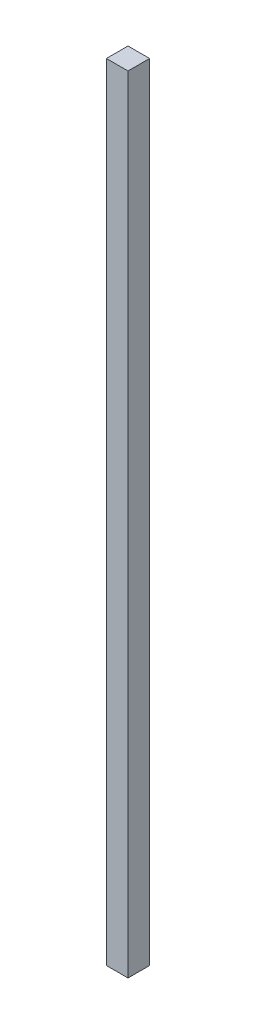
ISO-10303-21;
HEADER;
FILE_DESCRIPTION(('STEP AP214'),'2;1');
FILE_NAME('part.step','',(''),(''),'','','');
FILE_SCHEMA(('AUTOMOTIVE_DESIGN { 1 0 10303 214 1 1 1 1 }'));
ENDSEC;
DATA;
#1=APPLICATION_CONTEXT('core data for automotive mechanical design processes');
#2=APPLICATION_PROTOCOL_DEFINITION('international standard','automotive_design',2000,#1);
#3=PRODUCT_CONTEXT('',#1,'mechanical');
#4=PRODUCT('Part','Part','',(#3));
#5=PRODUCT_RELATED_PRODUCT_CATEGORY('part','',(#4));
#6=PRODUCT_DEFINITION_FORMATION('','',#4);
#7=PRODUCT_DEFINITION_CONTEXT('part definition',#1,'design');
#8=PRODUCT_DEFINITION('design','',#6,#7);
#9=PRODUCT_DEFINITION_SHAPE('','',#8);
#10=(LENGTH_UNIT() NAMED_UNIT(*) SI_UNIT(.MILLI.,.METRE.));
#11=(NAMED_UNIT(*) PLANE_ANGLE_UNIT() SI_UNIT($,.RADIAN.));
#12=(NAMED_UNIT(*) SI_UNIT($,.STERADIAN.) SOLID_ANGLE_UNIT());
#13=UNCERTAINTY_MEASURE_WITH_UNIT(LENGTH_MEASURE(1.E-05),#10,'distance_accuracy_value','');
#14=(GEOMETRIC_REPRESENTATION_CONTEXT(3) GLOBAL_UNCERTAINTY_ASSIGNED_CONTEXT((#13)) GLOBAL_UNIT_ASSIGNED_CONTEXT((#10,
#11,#12)) REPRESENTATION_CONTEXT('',''));
#15=CARTESIAN_POINT('',(0.,0.,0.));
#16=DIRECTION('',(0.,0.,1.));
#17=DIRECTION('',(1.,0.,0.));
#18=AXIS2_PLACEMENT_3D('',#15,#16,#17);
#19=CARTESIAN_POINT('',(1.5,243.242640687119,-1.5));
#20=DIRECTION('',(-1.,0.,0.));
#21=DIRECTION('',(0.,0.,1.));
#22=AXIS2_PLACEMENT_3D('',#19,#20,#21);
#23=PLANE('',#22);
#24=DIRECTION('',(0.,0.,-1.));
#25=VECTOR('',#24,1.);
#26=CARTESIAN_POINT('',(1.5,239.,-1.5));
#27=LINE('',#26,#25);
#28=CARTESIAN_POINT('',(1.5,239.,1.5));
#29=VERTEX_POINT('',#28);
#30=CARTESIAN_POINT('',(1.5,239.,-1.5));
#31=VERTEX_POINT('',#30);
#32=EDGE_CURVE('E97',#29,#31,#27,.T.);
#33=ORIENTED_EDGE('',*,*,#32,.F.);
#34=DIRECTION('',(0.,-1.,0.));
#35=VECTOR('',#34,1.);
#36=CARTESIAN_POINT('',(1.5,243.242640687119,1.5));
#37=LINE('',#36,#35);
#38=CARTESIAN_POINT('',(1.5,130.,1.5));
#39=VERTEX_POINT('',#38);
#40=EDGE_CURVE('E36',#29,#39,#37,.T.);
#41=ORIENTED_EDGE('',*,*,#40,.T.);
#42=DIRECTION('',(0.,0.,-1.));
#43=VECTOR('',#42,1.);
#44=CARTESIAN_POINT('',(1.5,130.,-1.5));
#45=LINE('',#44,#43);
#46=CARTESIAN_POINT('',(1.5,130.,-1.5));
#47=VERTEX_POINT('',#46);
#48=EDGE_CURVE('E49',#39,#47,#45,.T.);
#49=ORIENTED_EDGE('',*,*,#48,.T.);
#50=DIRECTION('',(0.,-1.,0.));
#51=VECTOR('',#50,1.);
#52=CARTESIAN_POINT('',(1.5,243.242640687119,-1.5));
#53=LINE('',#52,#51);
#54=EDGE_CURVE('E93',#31,#47,#53,.T.);
#55=ORIENTED_EDGE('',*,*,#54,.F.);
#56=EDGE_LOOP('',(#33,#41,#49,#55));
#57=FACE_BOUND('',#56,.T.);
#58=ADVANCED_FACE('F32',(#57),#23,.F.);
#59=CARTESIAN_POINT('',(-1.5,243.242640687119,-1.5));
#60=DIRECTION('',(0.,0.,1.));
#61=DIRECTION('',(1.,0.,0.));
#62=AXIS2_PLACEMENT_3D('',#59,#60,#61);
#63=PLANE('',#62);
#64=DIRECTION('',(-1.,0.,0.));
#65=VECTOR('',#64,1.);
#66=CARTESIAN_POINT('',(-1.5,239.,-1.5));
#67=LINE('',#66,#65);
#68=CARTESIAN_POINT('',(-1.5,239.,-1.5));
#69=VERTEX_POINT('',#68);
#70=EDGE_CURVE('E41',#31,#69,#67,.T.);
#71=ORIENTED_EDGE('',*,*,#70,.F.);
#72=ORIENTED_EDGE('',*,*,#54,.T.);
#73=DIRECTION('',(-1.,0.,0.));
#74=VECTOR('',#73,1.);
#75=CARTESIAN_POINT('',(-1.5,130.,-1.5));
#76=LINE('',#75,#74);
#77=CARTESIAN_POINT('',(-1.5,130.,-1.5));
#78=VERTEX_POINT('',#77);
#79=EDGE_CURVE('E89',#47,#78,#76,.T.);
#80=ORIENTED_EDGE('',*,*,#79,.T.);
#81=DIRECTION('',(0.,-1.,0.));
#82=VECTOR('',#81,1.);
#83=CARTESIAN_POINT('',(-1.5,243.242640687119,-1.5));
#84=LINE('',#83,#82);
#85=EDGE_CURVE('E86',#69,#78,#84,.T.);
#86=ORIENTED_EDGE('',*,*,#85,.F.);
#87=EDGE_LOOP('',(#71,#72,#80,#86));
#88=FACE_BOUND('',#87,.T.);
#89=ADVANCED_FACE('F104',(#88),#63,.F.);
#90=CARTESIAN_POINT('',(-1.5,243.242640687119,-1.5));
#91=DIRECTION('',(1.,0.,0.));
#92=DIRECTION('',(0.,0.,-1.));
#93=AXIS2_PLACEMENT_3D('',#90,#91,#92);
#94=PLANE('',#93);
#95=DIRECTION('',(0.,0.,1.));
#96=VECTOR('',#95,1.);
#97=CARTESIAN_POINT('',(-1.5,239.,-1.5));
#98=LINE('',#97,#96);
#99=CARTESIAN_POINT('',(-1.5,239.,1.5));
#100=VERTEX_POINT('',#99);
#101=EDGE_CURVE('E11',#69,#100,#98,.T.);
#102=ORIENTED_EDGE('',*,*,#101,.F.);
#103=ORIENTED_EDGE('',*,*,#85,.T.);
#104=DIRECTION('',(0.,0.,1.));
#105=VECTOR('',#104,1.);
#106=CARTESIAN_POINT('',(-1.5,130.,-1.5));
#107=LINE('',#106,#105);
#108=CARTESIAN_POINT('',(-1.5,130.,1.5));
#109=VERTEX_POINT('',#108);
#110=EDGE_CURVE('E76',#78,#109,#107,.T.);
#111=ORIENTED_EDGE('',*,*,#110,.T.);
#112=DIRECTION('',(0.,-1.,0.));
#113=VECTOR('',#112,1.);
#114=CARTESIAN_POINT('',(-1.5,243.242640687119,1.5));
#115=LINE('',#114,#113);
#116=EDGE_CURVE('E79',#100,#109,#115,.T.);
#117=ORIENTED_EDGE('',*,*,#116,.F.);
#118=EDGE_LOOP('',(#102,#103,#111,#117));
#119=FACE_BOUND('',#118,.T.);
#120=ADVANCED_FACE('F84',(#119),#94,.F.);
#121=CARTESIAN_POINT('',(-1.5,243.242640687119,1.5));
#122=DIRECTION('',(0.,0.,-1.));
#123=DIRECTION('',(-1.,0.,0.));
#124=AXIS2_PLACEMENT_3D('',#121,#122,#123);
#125=PLANE('',#124);
#126=DIRECTION('',(1.,0.,0.));
#127=VECTOR('',#126,1.);
#128=CARTESIAN_POINT('',(-1.5,239.,1.5));
#129=LINE('',#128,#127);
#130=EDGE_CURVE('E78',#100,#29,#129,.T.);
#131=ORIENTED_EDGE('',*,*,#130,.F.);
#132=ORIENTED_EDGE('',*,*,#116,.T.);
#133=DIRECTION('',(1.,0.,0.));
#134=VECTOR('',#133,1.);
#135=CARTESIAN_POINT('',(-1.5,130.,1.5));
#136=LINE('',#135,#134);
#137=EDGE_CURVE('E72',#109,#39,#136,.T.);
#138=ORIENTED_EDGE('',*,*,#137,.T.);
#139=ORIENTED_EDGE('',*,*,#40,.F.);
#140=EDGE_LOOP('',(#131,#132,#138,#139));
#141=FACE_BOUND('',#140,.T.);
#142=ADVANCED_FACE('F81',(#141),#125,.F.);
#143=CARTESIAN_POINT('',(0.,239.,0.));
#144=DIRECTION('',(0.,1.,0.));
#145=DIRECTION('',(0.,0.,1.));
#146=AXIS2_PLACEMENT_3D('',#143,#144,#145);
#147=PLANE('',#146);
#148=ORIENTED_EDGE('',*,*,#130,.T.);
#149=ORIENTED_EDGE('',*,*,#32,.T.);
#150=ORIENTED_EDGE('',*,*,#70,.T.);
#151=ORIENTED_EDGE('',*,*,#101,.T.);
#152=EDGE_LOOP('',(#148,#149,#150,#151));
#153=FACE_BOUND('',#152,.T.);
#154=ADVANCED_FACE('F34',(#153),#147,.T.);
#155=CARTESIAN_POINT('',(0.,130.,0.));
#156=DIRECTION('',(0.,1.,0.));
#157=DIRECTION('',(0.,0.,1.));
#158=AXIS2_PLACEMENT_3D('',#155,#156,#157);
#159=PLANE('',#158);
#160=ORIENTED_EDGE('',*,*,#137,.F.);
#161=ORIENTED_EDGE('',*,*,#110,.F.);
#162=ORIENTED_EDGE('',*,*,#79,.F.);
#163=ORIENTED_EDGE('',*,*,#48,.F.);
#164=EDGE_LOOP('',(#160,#161,#162,#163));
#165=FACE_BOUND('',#164,.T.);
#166=ADVANCED_FACE('F74',(#165),#159,.F.);
#167=CLOSED_SHELL('',(#58,#89,#120,#142,#154,#166));
#168=MANIFOLD_SOLID_BREP('B2',#167);
#169=ADVANCED_BREP_SHAPE_REPRESENTATION('',(#18,#168),#14);
#170=SHAPE_DEFINITION_REPRESENTATION(#9,#169);
ENDSEC;
END-ISO-10303-21;
